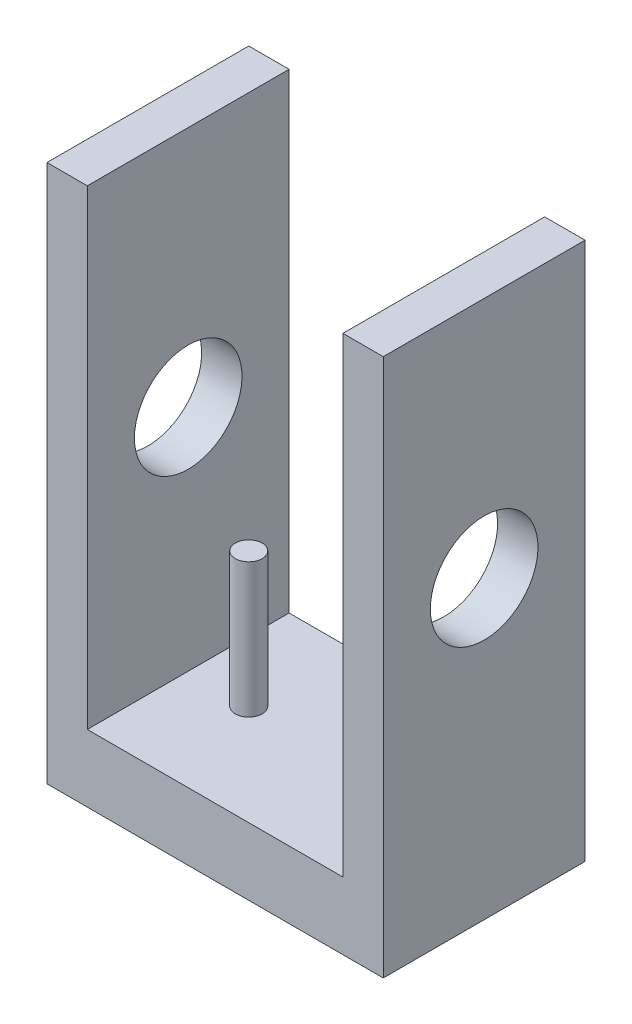
ISO-10303-21;
HEADER;
FILE_DESCRIPTION(('STEP AP214'),'2;1');
FILE_NAME('part.step','',(''),(''),'','','');
FILE_SCHEMA(('AUTOMOTIVE_DESIGN { 1 0 10303 214 1 1 1 1 }'));
ENDSEC;
DATA;
#1=APPLICATION_CONTEXT('core data for automotive mechanical design processes');
#2=APPLICATION_PROTOCOL_DEFINITION('international standard','automotive_design',2000,#1);
#3=PRODUCT_CONTEXT('',#1,'mechanical');
#4=PRODUCT('Part','Part','',(#3));
#5=PRODUCT_RELATED_PRODUCT_CATEGORY('part','',(#4));
#6=PRODUCT_DEFINITION_FORMATION('','',#4);
#7=PRODUCT_DEFINITION_CONTEXT('part definition',#1,'design');
#8=PRODUCT_DEFINITION('design','',#6,#7);
#9=PRODUCT_DEFINITION_SHAPE('','',#8);
#10=(LENGTH_UNIT() NAMED_UNIT(*) SI_UNIT(.MILLI.,.METRE.));
#11=(NAMED_UNIT(*) PLANE_ANGLE_UNIT() SI_UNIT($,.RADIAN.));
#12=(NAMED_UNIT(*) SI_UNIT($,.STERADIAN.) SOLID_ANGLE_UNIT());
#13=UNCERTAINTY_MEASURE_WITH_UNIT(LENGTH_MEASURE(1.E-05),#10,'distance_accuracy_value','');
#14=(GEOMETRIC_REPRESENTATION_CONTEXT(3) GLOBAL_UNCERTAINTY_ASSIGNED_CONTEXT((#13)) GLOBAL_UNIT_ASSIGNED_CONTEXT((#10,
#11,#12)) REPRESENTATION_CONTEXT('',''));
#15=CARTESIAN_POINT('',(0.,0.,0.));
#16=DIRECTION('',(0.,0.,1.));
#17=DIRECTION('',(1.,0.,0.));
#18=AXIS2_PLACEMENT_3D('',#15,#16,#17);
#19=CARTESIAN_POINT('',(0.,0.,15.));
#20=DIRECTION('',(0.,-1.,0.));
#21=DIRECTION('',(0.,0.,-1.));
#22=AXIS2_PLACEMENT_3D('',#19,#20,#21);
#23=PLANE('',#22);
#24=DIRECTION('',(0.,0.,-1.));
#25=VECTOR('',#24,1.);
#26=CARTESIAN_POINT('',(3.,0.,15.));
#27=LINE('',#26,#25);
#28=CARTESIAN_POINT('',(3.,0.,15.));
#29=VERTEX_POINT('',#28);
#30=CARTESIAN_POINT('',(3.,0.,0.));
#31=VERTEX_POINT('',#30);
#32=EDGE_CURVE('E120',#29,#31,#27,.T.);
#33=ORIENTED_EDGE('',*,*,#32,.T.);
#34=DIRECTION('',(-1.,0.,0.));
#35=VECTOR('',#34,1.);
#36=CARTESIAN_POINT('',(0.,0.,0.));
#37=LINE('',#36,#35);
#38=CARTESIAN_POINT('',(0.,0.,0.));
#39=VERTEX_POINT('',#38);
#40=EDGE_CURVE('E86',#31,#39,#37,.T.);
#41=ORIENTED_EDGE('',*,*,#40,.T.);
#42=DIRECTION('',(0.,0.,-1.));
#43=VECTOR('',#42,1.);
#44=CARTESIAN_POINT('',(0.,0.,15.));
#45=LINE('',#44,#43);
#46=CARTESIAN_POINT('',(0.,0.,15.));
#47=VERTEX_POINT('',#46);
#48=EDGE_CURVE('E171',#47,#39,#45,.T.);
#49=ORIENTED_EDGE('',*,*,#48,.F.);
#50=DIRECTION('',(-1.,0.,0.));
#51=VECTOR('',#50,1.);
#52=CARTESIAN_POINT('',(0.,0.,15.));
#53=LINE('',#52,#51);
#54=EDGE_CURVE('E64',#29,#47,#53,.T.);
#55=ORIENTED_EDGE('',*,*,#54,.F.);
#56=EDGE_LOOP('',(#33,#41,#49,#55));
#57=FACE_BOUND('',#56,.T.);
#58=ADVANCED_FACE('F38',(#57),#23,.F.);
#59=DIRECTION('',(0.,0.,-1.));
#60=VECTOR('',#59,1.);
#61=CARTESIAN_POINT('',(22.,0.,15.));
#62=LINE('',#61,#60);
#63=CARTESIAN_POINT('',(22.,0.,15.));
#64=VERTEX_POINT('',#63);
#65=CARTESIAN_POINT('',(22.,0.,0.));
#66=VERTEX_POINT('',#65);
#67=EDGE_CURVE('E55',#64,#66,#62,.T.);
#68=ORIENTED_EDGE('',*,*,#67,.F.);
#69=CARTESIAN_POINT('',(25.,0.,15.));
#70=VERTEX_POINT('',#69);
#71=EDGE_CURVE('E168',#70,#64,#53,.T.);
#72=ORIENTED_EDGE('',*,*,#71,.F.);
#73=DIRECTION('',(0.,0.,-1.));
#74=VECTOR('',#73,1.);
#75=CARTESIAN_POINT('',(25.,0.,15.));
#76=LINE('',#75,#74);
#77=CARTESIAN_POINT('',(25.,0.,0.));
#78=VERTEX_POINT('',#77);
#79=EDGE_CURVE('E186',#70,#78,#76,.T.);
#80=ORIENTED_EDGE('',*,*,#79,.T.);
#81=EDGE_CURVE('E162',#78,#66,#37,.T.);
#82=ORIENTED_EDGE('',*,*,#81,.T.);
#83=EDGE_LOOP('',(#68,#72,#80,#82));
#84=FACE_BOUND('',#83,.T.);
#85=ADVANCED_FACE('F202',(#84),#23,.F.);
#86=CARTESIAN_POINT('',(0.,0.,15.));
#87=DIRECTION('',(0.,0.,1.));
#88=DIRECTION('',(1.,0.,0.));
#89=AXIS2_PLACEMENT_3D('',#86,#87,#88);
#90=PLANE('',#89);
#91=DIRECTION('',(1.,0.,0.));
#92=VECTOR('',#91,1.);
#93=CARTESIAN_POINT('',(3.,-35.,15.));
#94=LINE('',#93,#92);
#95=CARTESIAN_POINT('',(3.,-35.,15.));
#96=VERTEX_POINT('',#95);
#97=CARTESIAN_POINT('',(22.,-35.,15.));
#98=VERTEX_POINT('',#97);
#99=EDGE_CURVE('E123',#96,#98,#94,.T.);
#100=ORIENTED_EDGE('',*,*,#99,.F.);
#101=DIRECTION('',(0.,-1.,0.));
#102=VECTOR('',#101,1.);
#103=CARTESIAN_POINT('',(3.,0.,15.));
#104=LINE('',#103,#102);
#105=EDGE_CURVE('E115',#29,#96,#104,.T.);
#106=ORIENTED_EDGE('',*,*,#105,.F.);
#107=ORIENTED_EDGE('',*,*,#54,.T.);
#108=DIRECTION('',(0.,-1.,0.));
#109=VECTOR('',#108,1.);
#110=CARTESIAN_POINT('',(0.,0.,15.));
#111=LINE('',#110,#109);
#112=CARTESIAN_POINT('',(0.,-40.,15.));
#113=VERTEX_POINT('',#112);
#114=EDGE_CURVE('E159',#47,#113,#111,.T.);
#115=ORIENTED_EDGE('',*,*,#114,.T.);
#116=DIRECTION('',(1.,0.,0.));
#117=VECTOR('',#116,1.);
#118=CARTESIAN_POINT('',(0.,-40.,15.));
#119=LINE('',#118,#117);
#120=CARTESIAN_POINT('',(25.,-40.,15.));
#121=VERTEX_POINT('',#120);
#122=EDGE_CURVE('E93',#113,#121,#119,.T.);
#123=ORIENTED_EDGE('',*,*,#122,.T.);
#124=DIRECTION('',(0.,1.,0.));
#125=VECTOR('',#124,1.);
#126=CARTESIAN_POINT('',(25.,0.,15.));
#127=LINE('',#126,#125);
#128=EDGE_CURVE('E165',#121,#70,#127,.T.);
#129=ORIENTED_EDGE('',*,*,#128,.T.);
#130=ORIENTED_EDGE('',*,*,#71,.T.);
#131=DIRECTION('',(0.,1.,0.));
#132=VECTOR('',#131,1.);
#133=CARTESIAN_POINT('',(22.,0.,15.));
#134=LINE('',#133,#132);
#135=EDGE_CURVE('E138',#98,#64,#134,.T.);
#136=ORIENTED_EDGE('',*,*,#135,.F.);
#137=EDGE_LOOP('',(#100,#106,#107,#115,#123,#129,#130,#136));
#138=FACE_BOUND('',#137,.T.);
#139=ADVANCED_FACE('F136',(#138),#90,.T.);
#140=CARTESIAN_POINT('',(0.,0.,0.));
#141=DIRECTION('',(0.,0.,1.));
#142=DIRECTION('',(1.,0.,0.));
#143=AXIS2_PLACEMENT_3D('',#140,#141,#142);
#144=PLANE('',#143);
#145=DIRECTION('',(0.,-1.,0.));
#146=VECTOR('',#145,1.);
#147=CARTESIAN_POINT('',(3.,0.,0.));
#148=LINE('',#147,#146);
#149=CARTESIAN_POINT('',(3.,-35.,0.));
#150=VERTEX_POINT('',#149);
#151=EDGE_CURVE('E145',#31,#150,#148,.T.);
#152=ORIENTED_EDGE('',*,*,#151,.T.);
#153=DIRECTION('',(1.,0.,0.));
#154=VECTOR('',#153,1.);
#155=CARTESIAN_POINT('',(3.,-35.,0.));
#156=LINE('',#155,#154);
#157=CARTESIAN_POINT('',(22.,-35.,0.));
#158=VERTEX_POINT('',#157);
#159=EDGE_CURVE('E130',#150,#158,#156,.T.);
#160=ORIENTED_EDGE('',*,*,#159,.T.);
#161=DIRECTION('',(0.,1.,0.));
#162=VECTOR('',#161,1.);
#163=CARTESIAN_POINT('',(22.,0.,0.));
#164=LINE('',#163,#162);
#165=EDGE_CURVE('E124',#158,#66,#164,.T.);
#166=ORIENTED_EDGE('',*,*,#165,.T.);
#167=ORIENTED_EDGE('',*,*,#81,.F.);
#168=DIRECTION('',(0.,1.,0.));
#169=VECTOR('',#168,1.);
#170=CARTESIAN_POINT('',(25.,0.,0.));
#171=LINE('',#170,#169);
#172=CARTESIAN_POINT('',(25.,-40.,0.));
#173=VERTEX_POINT('',#172);
#174=EDGE_CURVE('E178',#173,#78,#171,.T.);
#175=ORIENTED_EDGE('',*,*,#174,.F.);
#176=DIRECTION('',(1.,0.,0.));
#177=VECTOR('',#176,1.);
#178=CARTESIAN_POINT('',(0.,-40.,0.));
#179=LINE('',#178,#177);
#180=CARTESIAN_POINT('',(0.,-40.,0.));
#181=VERTEX_POINT('',#180);
#182=EDGE_CURVE('E175',#181,#173,#179,.T.);
#183=ORIENTED_EDGE('',*,*,#182,.F.);
#184=DIRECTION('',(0.,-1.,0.));
#185=VECTOR('',#184,1.);
#186=CARTESIAN_POINT('',(0.,0.,0.));
#187=LINE('',#186,#185);
#188=EDGE_CURVE('E132',#39,#181,#187,.T.);
#189=ORIENTED_EDGE('',*,*,#188,.F.);
#190=ORIENTED_EDGE('',*,*,#40,.F.);
#191=EDGE_LOOP('',(#152,#160,#166,#167,#175,#183,#189,#190));
#192=FACE_BOUND('',#191,.T.);
#193=ADVANCED_FACE('F199',(#192),#144,.F.);
#194=CARTESIAN_POINT('',(0.,0.,15.));
#195=DIRECTION('',(1.,0.,0.));
#196=DIRECTION('',(0.,0.,-1.));
#197=AXIS2_PLACEMENT_3D('',#194,#195,#196);
#198=PLANE('',#197);
#199=CARTESIAN_POINT('',(0.,-18.,7.5));
#200=DIRECTION('',(-1.,0.,0.));
#201=DIRECTION('',(0.,0.,1.));
#202=AXIS2_PLACEMENT_3D('',#199,#200,#201);
#203=CIRCLE('',#202,4.);
#204=CARTESIAN_POINT('',(0.,-18.,11.5));
#205=VERTEX_POINT('',#204);
#206=EDGE_CURVE('E259',#205,#205,#203,.T.);
#207=ORIENTED_EDGE('',*,*,#206,.F.);
#208=EDGE_LOOP('',(#207));
#209=FACE_BOUND('',#208,.T.);
#210=ORIENTED_EDGE('',*,*,#188,.T.);
#211=DIRECTION('',(0.,0.,-1.));
#212=VECTOR('',#211,1.);
#213=CARTESIAN_POINT('',(0.,-40.,15.));
#214=LINE('',#213,#212);
#215=EDGE_CURVE('E11',#113,#181,#214,.T.);
#216=ORIENTED_EDGE('',*,*,#215,.F.);
#217=ORIENTED_EDGE('',*,*,#114,.F.);
#218=ORIENTED_EDGE('',*,*,#48,.T.);
#219=EDGE_LOOP('',(#210,#216,#217,#218));
#220=FACE_BOUND('',#219,.T.);
#221=ADVANCED_FACE('F40',(#209,#220),#198,.F.);
#222=CARTESIAN_POINT('',(0.,-40.,15.));
#223=DIRECTION('',(0.,1.,0.));
#224=DIRECTION('',(0.,0.,1.));
#225=AXIS2_PLACEMENT_3D('',#222,#223,#224);
#226=PLANE('',#225);
#227=ORIENTED_EDGE('',*,*,#182,.T.);
#228=DIRECTION('',(0.,0.,-1.));
#229=VECTOR('',#228,1.);
#230=CARTESIAN_POINT('',(25.,-40.,15.));
#231=LINE('',#230,#229);
#232=EDGE_CURVE('E48',#121,#173,#231,.T.);
#233=ORIENTED_EDGE('',*,*,#232,.F.);
#234=ORIENTED_EDGE('',*,*,#122,.F.);
#235=ORIENTED_EDGE('',*,*,#215,.T.);
#236=EDGE_LOOP('',(#227,#233,#234,#235));
#237=FACE_BOUND('',#236,.T.);
#238=ADVANCED_FACE('F207',(#237),#226,.F.);
#239=CARTESIAN_POINT('',(25.,0.,15.));
#240=DIRECTION('',(-1.,0.,0.));
#241=DIRECTION('',(0.,0.,1.));
#242=AXIS2_PLACEMENT_3D('',#239,#240,#241);
#243=PLANE('',#242);
#244=CARTESIAN_POINT('',(25.,-18.,7.5));
#245=DIRECTION('',(-1.,0.,0.));
#246=DIRECTION('',(0.,0.,1.));
#247=AXIS2_PLACEMENT_3D('',#244,#245,#246);
#248=CIRCLE('',#247,4.);
#249=CARTESIAN_POINT('',(25.,-18.,11.5));
#250=VERTEX_POINT('',#249);
#251=EDGE_CURVE('E257',#250,#250,#248,.T.);
#252=ORIENTED_EDGE('',*,*,#251,.T.);
#253=EDGE_LOOP('',(#252));
#254=FACE_BOUND('',#253,.T.);
#255=ORIENTED_EDGE('',*,*,#174,.T.);
#256=ORIENTED_EDGE('',*,*,#79,.F.);
#257=ORIENTED_EDGE('',*,*,#128,.F.);
#258=ORIENTED_EDGE('',*,*,#232,.T.);
#259=EDGE_LOOP('',(#255,#256,#257,#258));
#260=FACE_BOUND('',#259,.T.);
#261=ADVANCED_FACE('F195',(#254,#260),#243,.F.);
#262=CARTESIAN_POINT('',(3.,0.,15.));
#263=DIRECTION('',(1.,0.,0.));
#264=DIRECTION('',(0.,1.,0.));
#265=AXIS2_PLACEMENT_3D('',#262,#263,#264);
#266=PLANE('',#265);
#267=CARTESIAN_POINT('',(3.,-18.,7.5));
#268=DIRECTION('',(1.,0.,0.));
#269=DIRECTION('',(0.,1.,0.));
#270=AXIS2_PLACEMENT_3D('',#267,#268,#269);
#271=CIRCLE('',#270,4.);
#272=CARTESIAN_POINT('',(3.,-14.,7.5));
#273=VERTEX_POINT('',#272);
#274=EDGE_CURVE('E263',#273,#273,#271,.T.);
#275=ORIENTED_EDGE('',*,*,#274,.F.);
#276=EDGE_LOOP('',(#275));
#277=FACE_BOUND('',#276,.T.);
#278=ORIENTED_EDGE('',*,*,#151,.F.);
#279=ORIENTED_EDGE('',*,*,#32,.F.);
#280=ORIENTED_EDGE('',*,*,#105,.T.);
#281=DIRECTION('',(0.,0.,-1.));
#282=VECTOR('',#281,1.);
#283=CARTESIAN_POINT('',(3.,-35.,15.));
#284=LINE('',#283,#282);
#285=EDGE_CURVE('E118',#96,#150,#284,.T.);
#286=ORIENTED_EDGE('',*,*,#285,.T.);
#287=EDGE_LOOP('',(#278,#279,#280,#286));
#288=FACE_BOUND('',#287,.T.);
#289=ADVANCED_FACE('F117',(#277,#288),#266,.T.);
#290=CARTESIAN_POINT('',(3.,-35.,15.));
#291=DIRECTION('',(0.,1.,0.));
#292=DIRECTION('',(0.,0.,1.));
#293=AXIS2_PLACEMENT_3D('',#290,#291,#292);
#294=PLANE('',#293);
#295=CARTESIAN_POINT('',(7.50000000000001,-35.,7.5));
#296=DIRECTION('',(0.,1.,0.));
#297=DIRECTION('',(0.,0.,1.));
#298=AXIS2_PLACEMENT_3D('',#295,#296,#297);
#299=CIRCLE('',#298,1.);
#300=CARTESIAN_POINT('',(7.50000000000001,-35.,8.5));
#301=VERTEX_POINT('',#300);
#302=EDGE_CURVE('E270',#301,#301,#299,.T.);
#303=ORIENTED_EDGE('',*,*,#302,.F.);
#304=EDGE_LOOP('',(#303));
#305=FACE_BOUND('',#304,.T.);
#306=ORIENTED_EDGE('',*,*,#159,.F.);
#307=ORIENTED_EDGE('',*,*,#285,.F.);
#308=ORIENTED_EDGE('',*,*,#99,.T.);
#309=DIRECTION('',(0.,0.,-1.));
#310=VECTOR('',#309,1.);
#311=CARTESIAN_POINT('',(22.,-35.,15.));
#312=LINE('',#311,#310);
#313=EDGE_CURVE('E133',#98,#158,#312,.T.);
#314=ORIENTED_EDGE('',*,*,#313,.T.);
#315=EDGE_LOOP('',(#306,#307,#308,#314));
#316=FACE_BOUND('',#315,.T.);
#317=ADVANCED_FACE('F127',(#305,#316),#294,.T.);
#318=CARTESIAN_POINT('',(22.,0.,15.));
#319=DIRECTION('',(-1.,0.,0.));
#320=DIRECTION('',(0.,-1.,0.));
#321=AXIS2_PLACEMENT_3D('',#318,#319,#320);
#322=PLANE('',#321);
#323=CARTESIAN_POINT('',(22.,-18.,7.5));
#324=DIRECTION('',(-1.,0.,0.));
#325=DIRECTION('',(0.,-1.,0.));
#326=AXIS2_PLACEMENT_3D('',#323,#324,#325);
#327=CIRCLE('',#326,4.);
#328=CARTESIAN_POINT('',(22.,-22.,7.5));
#329=VERTEX_POINT('',#328);
#330=EDGE_CURVE('E42',#329,#329,#327,.T.);
#331=ORIENTED_EDGE('',*,*,#330,.F.);
#332=EDGE_LOOP('',(#331));
#333=FACE_BOUND('',#332,.T.);
#334=ORIENTED_EDGE('',*,*,#165,.F.);
#335=ORIENTED_EDGE('',*,*,#313,.F.);
#336=ORIENTED_EDGE('',*,*,#135,.T.);
#337=ORIENTED_EDGE('',*,*,#67,.T.);
#338=EDGE_LOOP('',(#334,#335,#336,#337));
#339=FACE_BOUND('',#338,.T.);
#340=ADVANCED_FACE('F231',(#333,#339),#322,.T.);
#341=CARTESIAN_POINT('',(7.50000000000001,-25.,7.5));
#342=DIRECTION('',(0.,-1.,0.));
#343=DIRECTION('',(0.,0.,-1.));
#344=AXIS2_PLACEMENT_3D('',#341,#342,#343);
#345=CYLINDRICAL_SURFACE('',#344,1.);
#346=CARTESIAN_POINT('',(7.50000000000001,-25.,7.5));
#347=DIRECTION('',(0.,1.,0.));
#348=DIRECTION('',(0.,0.,1.));
#349=AXIS2_PLACEMENT_3D('',#346,#347,#348);
#350=CIRCLE('',#349,1.);
#351=CARTESIAN_POINT('',(7.50000000000001,-25.,8.5));
#352=VERTEX_POINT('',#351);
#353=EDGE_CURVE('E148',#352,#352,#350,.T.);
#354=ORIENTED_EDGE('',*,*,#353,.F.);
#355=EDGE_LOOP('',(#354));
#356=FACE_BOUND('',#355,.T.);
#357=ORIENTED_EDGE('',*,*,#302,.T.);
#358=EDGE_LOOP('',(#357));
#359=FACE_BOUND('',#358,.T.);
#360=ADVANCED_FACE('F235',(#356,#359),#345,.T.);
#361=CARTESIAN_POINT('',(7.50000000000001,-25.,7.5));
#362=DIRECTION('',(0.,1.,0.));
#363=DIRECTION('',(0.,0.,1.));
#364=AXIS2_PLACEMENT_3D('',#361,#362,#363);
#365=PLANE('',#364);
#366=ORIENTED_EDGE('',*,*,#353,.T.);
#367=EDGE_LOOP('',(#366));
#368=FACE_BOUND('',#367,.T.);
#369=ADVANCED_FACE('F239',(#368),#365,.T.);
#370=CARTESIAN_POINT('',(25.,-18.,7.5));
#371=DIRECTION('',(-1.,0.,0.));
#372=DIRECTION('',(0.,0.,1.));
#373=AXIS2_PLACEMENT_3D('',#370,#371,#372);
#374=CYLINDRICAL_SURFACE('',#373,4.);
#375=ORIENTED_EDGE('',*,*,#330,.T.);
#376=EDGE_LOOP('',(#375));
#377=FACE_BOUND('',#376,.T.);
#378=ORIENTED_EDGE('',*,*,#251,.F.);
#379=EDGE_LOOP('',(#378));
#380=FACE_BOUND('',#379,.T.);
#381=ADVANCED_FACE('F243',(#377,#380),#374,.F.);
#382=ORIENTED_EDGE('',*,*,#274,.T.);
#383=EDGE_LOOP('',(#382));
#384=FACE_BOUND('',#383,.T.);
#385=ORIENTED_EDGE('',*,*,#206,.T.);
#386=EDGE_LOOP('',(#385));
#387=FACE_BOUND('',#386,.T.);
#388=ADVANCED_FACE('F246',(#384,#387),#374,.F.);
#389=CLOSED_SHELL('',(#58,#85,#139,#193,#221,#238,#261,#289,#317,#340,#360,#369,#381,#388));
#390=MANIFOLD_SOLID_BREP('B2',#389);
#391=ADVANCED_BREP_SHAPE_REPRESENTATION('',(#18,#390),#14);
#392=SHAPE_DEFINITION_REPRESENTATION(#9,#391);
ENDSEC;
END-ISO-10303-21;
